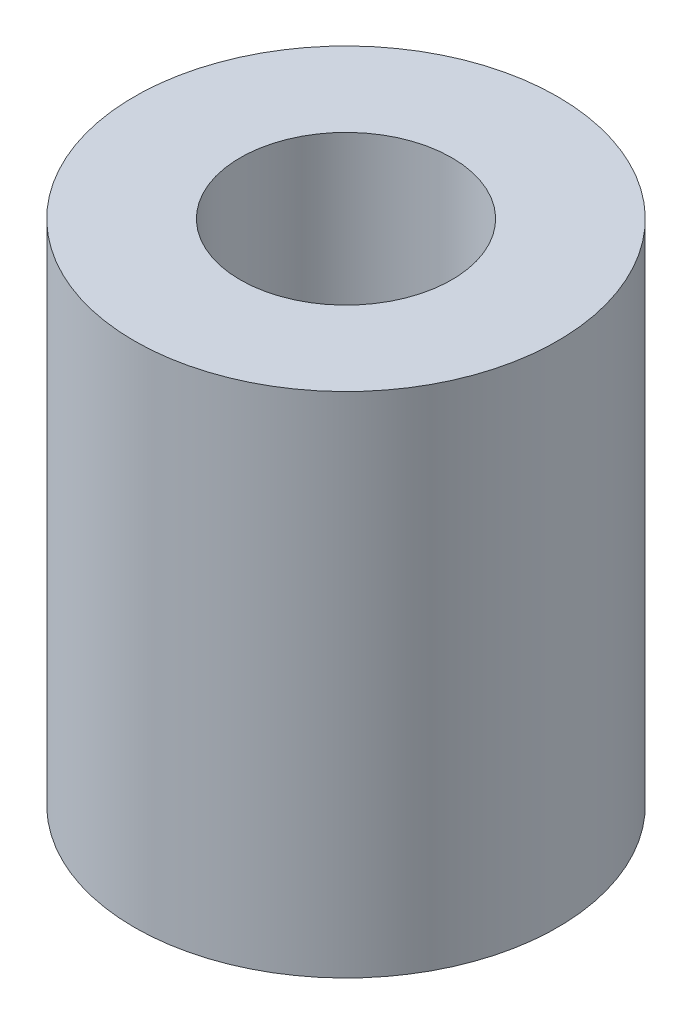
ISO-10303-21;
HEADER;
FILE_DESCRIPTION(('STEP AP214'),'2;1');
FILE_NAME('part.step','',(''),(''),'','','');
FILE_SCHEMA(('AUTOMOTIVE_DESIGN { 1 0 10303 214 1 1 1 1 }'));
ENDSEC;
DATA;
#1=APPLICATION_CONTEXT('core data for automotive mechanical design processes');
#2=APPLICATION_PROTOCOL_DEFINITION('international standard','automotive_design',2000,#1);
#3=PRODUCT_CONTEXT('',#1,'mechanical');
#4=PRODUCT('Part','Part','',(#3));
#5=PRODUCT_RELATED_PRODUCT_CATEGORY('part','',(#4));
#6=PRODUCT_DEFINITION_FORMATION('','',#4);
#7=PRODUCT_DEFINITION_CONTEXT('part definition',#1,'design');
#8=PRODUCT_DEFINITION('design','',#6,#7);
#9=PRODUCT_DEFINITION_SHAPE('','',#8);
#10=(LENGTH_UNIT() NAMED_UNIT(*) SI_UNIT(.MILLI.,.METRE.));
#11=(NAMED_UNIT(*) PLANE_ANGLE_UNIT() SI_UNIT($,.RADIAN.));
#12=(NAMED_UNIT(*) SI_UNIT($,.STERADIAN.) SOLID_ANGLE_UNIT());
#13=UNCERTAINTY_MEASURE_WITH_UNIT(LENGTH_MEASURE(1.E-05),#10,'distance_accuracy_value','');
#14=(GEOMETRIC_REPRESENTATION_CONTEXT(3) GLOBAL_UNCERTAINTY_ASSIGNED_CONTEXT((#13)) GLOBAL_UNIT_ASSIGNED_CONTEXT((#10,
#11,#12)) REPRESENTATION_CONTEXT('',''));
#15=CARTESIAN_POINT('',(0.,0.,0.));
#16=DIRECTION('',(0.,0.,1.));
#17=DIRECTION('',(1.,0.,0.));
#18=AXIS2_PLACEMENT_3D('',#15,#16,#17);
#19=CARTESIAN_POINT('',(0.,24.,0.));
#20=DIRECTION('',(0.,-1.,0.));
#21=DIRECTION('',(0.,0.,-1.));
#22=AXIS2_PLACEMENT_3D('',#19,#20,#21);
#23=CYLINDRICAL_SURFACE('',#22,10.);
#24=CARTESIAN_POINT('',(0.,24.,0.));
#25=DIRECTION('',(0.,1.,0.));
#26=DIRECTION('',(0.,0.,1.));
#27=AXIS2_PLACEMENT_3D('',#24,#25,#26);
#28=CIRCLE('',#27,10.);
#29=CARTESIAN_POINT('',(0.,24.,10.));
#30=VERTEX_POINT('',#29);
#31=EDGE_CURVE('E10',#30,#30,#28,.T.);
#32=ORIENTED_EDGE('',*,*,#31,.F.);
#33=EDGE_LOOP('',(#32));
#34=FACE_BOUND('',#33,.T.);
#35=CARTESIAN_POINT('',(0.,0.,0.));
#36=DIRECTION('',(0.,1.,0.));
#37=DIRECTION('',(0.,0.,1.));
#38=AXIS2_PLACEMENT_3D('',#35,#36,#37);
#39=CIRCLE('',#38,10.);
#40=CARTESIAN_POINT('',(0.,0.,10.));
#41=VERTEX_POINT('',#40);
#42=EDGE_CURVE('E39',#41,#41,#39,.T.);
#43=ORIENTED_EDGE('',*,*,#42,.T.);
#44=EDGE_LOOP('',(#43));
#45=FACE_BOUND('',#44,.T.);
#46=ADVANCED_FACE('F36',(#34,#45),#23,.T.);
#47=CARTESIAN_POINT('',(0.,24.,0.));
#48=DIRECTION('',(0.,1.,0.));
#49=DIRECTION('',(0.,0.,1.));
#50=AXIS2_PLACEMENT_3D('',#47,#48,#49);
#51=PLANE('',#50);
#52=CARTESIAN_POINT('',(0.,24.,0.));
#53=DIRECTION('',(0.,1.,0.));
#54=DIRECTION('',(0.,0.,1.));
#55=AXIS2_PLACEMENT_3D('',#52,#53,#54);
#56=CIRCLE('',#55,5.);
#57=CARTESIAN_POINT('',(0.,24.,5.));
#58=VERTEX_POINT('',#57);
#59=EDGE_CURVE('E48',#58,#58,#56,.T.);
#60=ORIENTED_EDGE('',*,*,#59,.F.);
#61=EDGE_LOOP('',(#60));
#62=FACE_BOUND('',#61,.T.);
#63=ORIENTED_EDGE('',*,*,#31,.T.);
#64=EDGE_LOOP('',(#63));
#65=FACE_BOUND('',#64,.T.);
#66=ADVANCED_FACE('F73',(#62,#65),#51,.T.);
#67=CARTESIAN_POINT('',(0.,0.,0.));
#68=DIRECTION('',(0.,1.,0.));
#69=DIRECTION('',(0.,0.,1.));
#70=AXIS2_PLACEMENT_3D('',#67,#68,#69);
#71=PLANE('',#70);
#72=CARTESIAN_POINT('',(0.,0.,0.));
#73=DIRECTION('',(0.,-1.,0.));
#74=DIRECTION('',(0.,0.,-1.));
#75=AXIS2_PLACEMENT_3D('',#72,#73,#74);
#76=CIRCLE('',#75,2.5);
#77=CARTESIAN_POINT('',(0.,0.,-2.5));
#78=VERTEX_POINT('',#77);
#79=EDGE_CURVE('E54',#78,#78,#76,.T.);
#80=ORIENTED_EDGE('',*,*,#79,.F.);
#81=EDGE_LOOP('',(#80));
#82=FACE_BOUND('',#81,.T.);
#83=ORIENTED_EDGE('',*,*,#42,.F.);
#84=EDGE_LOOP('',(#83));
#85=FACE_BOUND('',#84,.T.);
#86=ADVANCED_FACE('F69',(#82,#85),#71,.F.);
#87=CARTESIAN_POINT('',(0.,12.,0.));
#88=DIRECTION('',(0.,1.,0.));
#89=DIRECTION('',(0.,0.,1.));
#90=AXIS2_PLACEMENT_3D('',#87,#88,#89);
#91=CYLINDRICAL_SURFACE('',#90,5.);
#92=CARTESIAN_POINT('',(0.,12.,0.));
#93=DIRECTION('',(0.,1.,0.));
#94=DIRECTION('',(0.,0.,1.));
#95=AXIS2_PLACEMENT_3D('',#92,#93,#94);
#96=CIRCLE('',#95,5.);
#97=CARTESIAN_POINT('',(0.,12.,5.));
#98=VERTEX_POINT('',#97);
#99=EDGE_CURVE('E46',#98,#98,#96,.T.);
#100=ORIENTED_EDGE('',*,*,#99,.F.);
#101=EDGE_LOOP('',(#100));
#102=FACE_BOUND('',#101,.T.);
#103=ORIENTED_EDGE('',*,*,#59,.T.);
#104=EDGE_LOOP('',(#103));
#105=FACE_BOUND('',#104,.T.);
#106=ADVANCED_FACE('F72',(#102,#105),#91,.F.);
#107=CARTESIAN_POINT('',(0.,12.,0.));
#108=DIRECTION('',(0.,1.,0.));
#109=DIRECTION('',(0.,0.,1.));
#110=AXIS2_PLACEMENT_3D('',#107,#108,#109);
#111=PLANE('',#110);
#112=CARTESIAN_POINT('',(0.,12.,0.));
#113=DIRECTION('',(0.,-1.,0.));
#114=DIRECTION('',(0.,0.,-1.));
#115=AXIS2_PLACEMENT_3D('',#112,#113,#114);
#116=CIRCLE('',#115,2.5);
#117=CARTESIAN_POINT('',(0.,12.,-2.5));
#118=VERTEX_POINT('',#117);
#119=EDGE_CURVE('E51',#118,#118,#116,.T.);
#120=ORIENTED_EDGE('',*,*,#119,.T.);
#121=EDGE_LOOP('',(#120));
#122=FACE_BOUND('',#121,.T.);
#123=ORIENTED_EDGE('',*,*,#99,.T.);
#124=EDGE_LOOP('',(#123));
#125=FACE_BOUND('',#124,.T.);
#126=ADVANCED_FACE('F60',(#122,#125),#111,.T.);
#127=CARTESIAN_POINT('',(0.,12.,0.));
#128=DIRECTION('',(0.,-1.,0.));
#129=DIRECTION('',(0.,0.,-1.));
#130=AXIS2_PLACEMENT_3D('',#127,#128,#129);
#131=CYLINDRICAL_SURFACE('',#130,2.5);
#132=ORIENTED_EDGE('',*,*,#119,.F.);
#133=EDGE_LOOP('',(#132));
#134=FACE_BOUND('',#133,.T.);
#135=ORIENTED_EDGE('',*,*,#79,.T.);
#136=EDGE_LOOP('',(#135));
#137=FACE_BOUND('',#136,.T.);
#138=ADVANCED_FACE('F63',(#134,#137),#131,.F.);
#139=CLOSED_SHELL('',(#46,#66,#86,#106,#126,#138));
#140=MANIFOLD_SOLID_BREP('B2',#139);
#141=ADVANCED_BREP_SHAPE_REPRESENTATION('',(#18,#140),#14);
#142=SHAPE_DEFINITION_REPRESENTATION(#9,#141);
ENDSEC;
END-ISO-10303-21;
